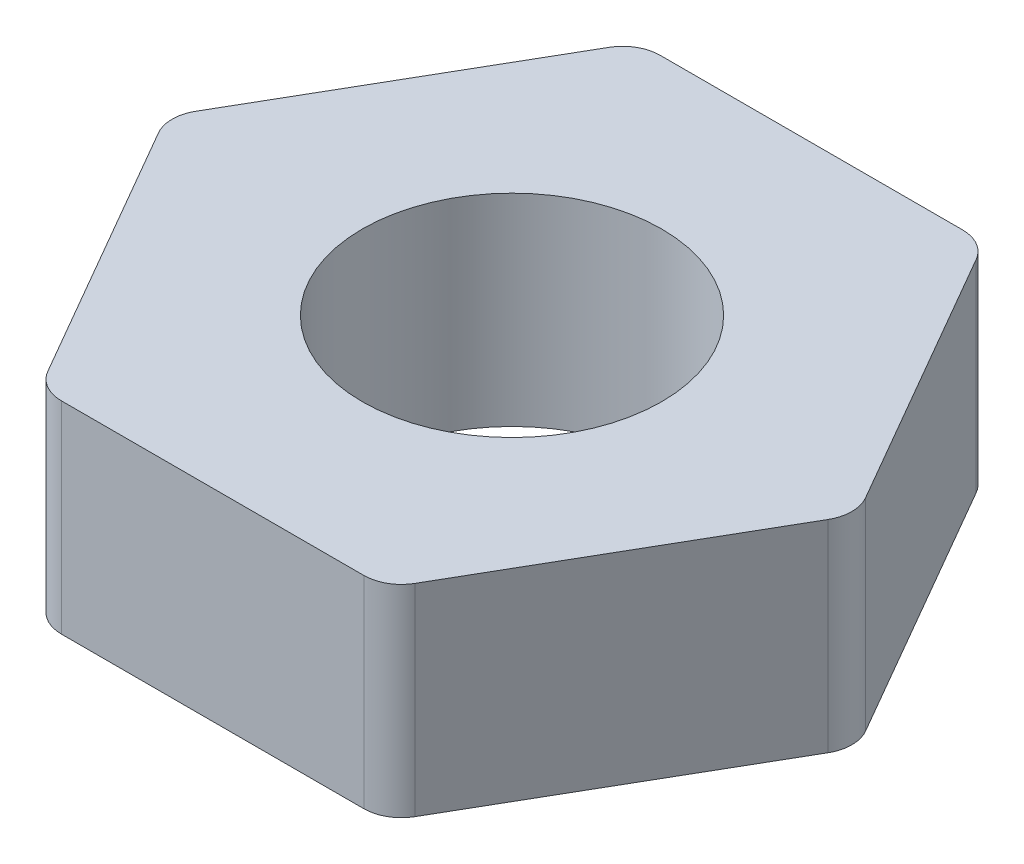
ISO-10303-21;
HEADER;
FILE_DESCRIPTION(('STEP AP214'),'2;1');
FILE_NAME('part.step','',(''),(''),'','','');
FILE_SCHEMA(('AUTOMOTIVE_DESIGN { 1 0 10303 214 1 1 1 1 }'));
ENDSEC;
DATA;
#1=APPLICATION_CONTEXT('core data for automotive mechanical design processes');
#2=APPLICATION_PROTOCOL_DEFINITION('international standard','automotive_design',2000,#1);
#3=PRODUCT_CONTEXT('',#1,'mechanical');
#4=PRODUCT('Part','Part','',(#3));
#5=PRODUCT_RELATED_PRODUCT_CATEGORY('part','',(#4));
#6=PRODUCT_DEFINITION_FORMATION('','',#4);
#7=PRODUCT_DEFINITION_CONTEXT('part definition',#1,'design');
#8=PRODUCT_DEFINITION('design','',#6,#7);
#9=PRODUCT_DEFINITION_SHAPE('','',#8);
#10=(LENGTH_UNIT() NAMED_UNIT(*) SI_UNIT(.MILLI.,.METRE.));
#11=(NAMED_UNIT(*) PLANE_ANGLE_UNIT() SI_UNIT($,.RADIAN.));
#12=(NAMED_UNIT(*) SI_UNIT($,.STERADIAN.) SOLID_ANGLE_UNIT());
#13=UNCERTAINTY_MEASURE_WITH_UNIT(LENGTH_MEASURE(1.E-05),#10,'distance_accuracy_value','');
#14=(GEOMETRIC_REPRESENTATION_CONTEXT(3) GLOBAL_UNCERTAINTY_ASSIGNED_CONTEXT((#13)) GLOBAL_UNIT_ASSIGNED_CONTEXT((#10,
#11,#12)) REPRESENTATION_CONTEXT('',''));
#15=CARTESIAN_POINT('',(0.,0.,0.));
#16=DIRECTION('',(0.,0.,1.));
#17=DIRECTION('',(1.,0.,0.));
#18=AXIS2_PLACEMENT_3D('',#15,#16,#17);
#19=CARTESIAN_POINT('',(0.,2.7,0.));
#20=DIRECTION('',(0.,1.,0.));
#21=DIRECTION('',(0.,0.,1.));
#22=AXIS2_PLACEMENT_3D('',#19,#20,#21);
#23=PLANE('',#22);
#24=DIRECTION('',(-0.5,0.,0.866025403784439));
#25=VECTOR('',#24,1.);
#26=CARTESIAN_POINT('',(-2.30940107675851,2.7,-4.00000000000001));
#27=LINE('',#26,#25);
#28=CARTESIAN_POINT('',(-2.45373864405591,2.7,-3.75000000000001));
#29=VERTEX_POINT('',#28);
#30=CARTESIAN_POINT('',(-4.47446458621961,2.7,-0.249999999999999));
#31=VERTEX_POINT('',#30);
#32=EDGE_CURVE('E220',#29,#31,#27,.T.);
#33=ORIENTED_EDGE('',*,*,#32,.T.);
#34=CARTESIAN_POINT('',(-4.04145188432739,2.7,0.));
#35=DIRECTION('',(0.,1.,0.));
#36=DIRECTION('',(0.,0.,1.));
#37=AXIS2_PLACEMENT_3D('',#34,#35,#36);
#38=CIRCLE('',#37,0.5);
#39=CARTESIAN_POINT('',(-4.47446458621961,2.7,0.25));
#40=VERTEX_POINT('',#39);
#41=EDGE_CURVE('E182',#31,#40,#38,.T.);
#42=ORIENTED_EDGE('',*,*,#41,.T.);
#43=DIRECTION('',(0.5,0.,0.866025403784438));
#44=VECTOR('',#43,1.);
#45=CARTESIAN_POINT('',(-4.61880215351701,2.7,0.));
#46=LINE('',#45,#44);
#47=CARTESIAN_POINT('',(-2.45373864405591,2.7,3.75));
#48=VERTEX_POINT('',#47);
#49=EDGE_CURVE('E144',#40,#48,#46,.T.);
#50=ORIENTED_EDGE('',*,*,#49,.T.);
#51=CARTESIAN_POINT('',(-2.02072594216369,2.7,3.50000000000001));
#52=DIRECTION('',(0.,1.,0.));
#53=DIRECTION('',(0.,0.,1.));
#54=AXIS2_PLACEMENT_3D('',#51,#52,#53);
#55=CIRCLE('',#54,0.5);
#56=CARTESIAN_POINT('',(-2.02072594216369,2.7,4.00000000000001));
#57=VERTEX_POINT('',#56);
#58=EDGE_CURVE('E57',#48,#57,#55,.T.);
#59=ORIENTED_EDGE('',*,*,#58,.T.);
#60=DIRECTION('',(1.,0.,0.));
#61=VECTOR('',#60,1.);
#62=CARTESIAN_POINT('',(-2.30940107675851,2.7,4.00000000000001));
#63=LINE('',#62,#61);
#64=CARTESIAN_POINT('',(2.02072594216369,2.7,4.00000000000001));
#65=VERTEX_POINT('',#64);
#66=EDGE_CURVE('E160',#57,#65,#63,.T.);
#67=ORIENTED_EDGE('',*,*,#66,.T.);
#68=CARTESIAN_POINT('',(2.02072594216369,2.7,3.50000000000001));
#69=DIRECTION('',(0.,1.,0.));
#70=DIRECTION('',(0.,0.,1.));
#71=AXIS2_PLACEMENT_3D('',#68,#69,#70);
#72=CIRCLE('',#71,0.5);
#73=CARTESIAN_POINT('',(2.45373864405591,2.7,3.75));
#74=VERTEX_POINT('',#73);
#75=EDGE_CURVE('E179',#65,#74,#72,.T.);
#76=ORIENTED_EDGE('',*,*,#75,.T.);
#77=DIRECTION('',(0.5,0.,-0.866025403784439));
#78=VECTOR('',#77,1.);
#79=CARTESIAN_POINT('',(2.3094010767585,2.7,4.00000000000001));
#80=LINE('',#79,#78);
#81=CARTESIAN_POINT('',(4.4744645862196,2.7,0.25));
#82=VERTEX_POINT('',#81);
#83=EDGE_CURVE('E154',#74,#82,#80,.T.);
#84=ORIENTED_EDGE('',*,*,#83,.T.);
#85=CARTESIAN_POINT('',(4.04145188432738,2.7,0.));
#86=DIRECTION('',(0.,1.,0.));
#87=DIRECTION('',(0.,0.,1.));
#88=AXIS2_PLACEMENT_3D('',#85,#86,#87);
#89=CIRCLE('',#88,0.5);
#90=CARTESIAN_POINT('',(4.4744645862196,2.7,-0.250000000000001));
#91=VERTEX_POINT('',#90);
#92=EDGE_CURVE('E177',#82,#91,#89,.T.);
#93=ORIENTED_EDGE('',*,*,#92,.T.);
#94=DIRECTION('',(-0.5,0.,-0.866025403784439));
#95=VECTOR('',#94,1.);
#96=CARTESIAN_POINT('',(4.618802153517,2.7,0.));
#97=LINE('',#96,#95);
#98=CARTESIAN_POINT('',(2.45373864405591,2.7,-3.75000000000001));
#99=VERTEX_POINT('',#98);
#100=EDGE_CURVE('E224',#91,#99,#97,.T.);
#101=ORIENTED_EDGE('',*,*,#100,.T.);
#102=CARTESIAN_POINT('',(2.02072594216369,2.7,-3.50000000000001));
#103=DIRECTION('',(0.,1.,0.));
#104=DIRECTION('',(0.,0.,1.));
#105=AXIS2_PLACEMENT_3D('',#102,#103,#104);
#106=CIRCLE('',#105,0.5);
#107=CARTESIAN_POINT('',(2.02072594216369,2.7,-4.00000000000001));
#108=VERTEX_POINT('',#107);
#109=EDGE_CURVE('E173',#99,#108,#106,.T.);
#110=ORIENTED_EDGE('',*,*,#109,.T.);
#111=DIRECTION('',(-1.,0.,0.));
#112=VECTOR('',#111,1.);
#113=CARTESIAN_POINT('',(2.3094010767585,2.7,-4.00000000000001));
#114=LINE('',#113,#112);
#115=CARTESIAN_POINT('',(-2.02072594216369,2.7,-4.00000000000001));
#116=VERTEX_POINT('',#115);
#117=EDGE_CURVE('E206',#108,#116,#114,.T.);
#118=ORIENTED_EDGE('',*,*,#117,.T.);
#119=CARTESIAN_POINT('',(-2.02072594216369,2.7,-3.50000000000001));
#120=DIRECTION('',(0.,1.,0.));
#121=DIRECTION('',(0.,0.,1.));
#122=AXIS2_PLACEMENT_3D('',#119,#120,#121);
#123=CIRCLE('',#122,0.5);
#124=EDGE_CURVE('E175',#116,#29,#123,.T.);
#125=ORIENTED_EDGE('',*,*,#124,.T.);
#126=EDGE_LOOP('',(#33,#42,#50,#59,#67,#76,#84,#93,#101,#110,#118,#125));
#127=FACE_BOUND('',#126,.T.);
#128=CARTESIAN_POINT('',(0.,2.7,0.));
#129=DIRECTION('',(0.,1.,0.));
#130=DIRECTION('',(0.,0.,1.));
#131=AXIS2_PLACEMENT_3D('',#128,#129,#130);
#132=CIRCLE('',#131,2.);
#133=CARTESIAN_POINT('',(0.,2.7,2.));
#134=VERTEX_POINT('',#133);
#135=EDGE_CURVE('E217',#134,#134,#132,.T.);
#136=ORIENTED_EDGE('',*,*,#135,.F.);
#137=EDGE_LOOP('',(#136));
#138=FACE_BOUND('',#137,.T.);
#139=ADVANCED_FACE('F35',(#127,#138),#23,.T.);
#140=CARTESIAN_POINT('',(0.,0.,0.));
#141=DIRECTION('',(0.,1.,0.));
#142=DIRECTION('',(0.,0.,1.));
#143=AXIS2_PLACEMENT_3D('',#140,#141,#142);
#144=PLANE('',#143);
#145=DIRECTION('',(0.5,0.,0.866025403784438));
#146=VECTOR('',#145,1.);
#147=CARTESIAN_POINT('',(-4.61880215351701,0.,0.));
#148=LINE('',#147,#146);
#149=CARTESIAN_POINT('',(-4.47446458621961,0.,0.25));
#150=VERTEX_POINT('',#149);
#151=CARTESIAN_POINT('',(-2.45373864405591,0.,3.75));
#152=VERTEX_POINT('',#151);
#153=EDGE_CURVE('E142',#150,#152,#148,.T.);
#154=ORIENTED_EDGE('',*,*,#153,.F.);
#155=CARTESIAN_POINT('',(-4.04145188432739,0.,0.));
#156=DIRECTION('',(0.,1.,0.));
#157=DIRECTION('',(0.,0.,1.));
#158=AXIS2_PLACEMENT_3D('',#155,#156,#157);
#159=CIRCLE('',#158,0.5);
#160=CARTESIAN_POINT('',(-4.47446458621961,0.,-0.249999999999999));
#161=VERTEX_POINT('',#160);
#162=EDGE_CURVE('E125',#150,#161,#159,.F.);
#163=ORIENTED_EDGE('',*,*,#162,.T.);
#164=DIRECTION('',(-0.5,0.,0.866025403784439));
#165=VECTOR('',#164,1.);
#166=CARTESIAN_POINT('',(-2.30940107675851,0.,-4.00000000000001));
#167=LINE('',#166,#165);
#168=CARTESIAN_POINT('',(-2.45373864405591,0.,-3.75000000000001));
#169=VERTEX_POINT('',#168);
#170=EDGE_CURVE('E152',#169,#161,#167,.T.);
#171=ORIENTED_EDGE('',*,*,#170,.F.);
#172=CARTESIAN_POINT('',(-2.02072594216369,0.,-3.50000000000001));
#173=DIRECTION('',(0.,1.,0.));
#174=DIRECTION('',(0.,0.,1.));
#175=AXIS2_PLACEMENT_3D('',#172,#173,#174);
#176=CIRCLE('',#175,0.5);
#177=CARTESIAN_POINT('',(-2.02072594216369,0.,-4.00000000000001));
#178=VERTEX_POINT('',#177);
#179=EDGE_CURVE('E163',#169,#178,#176,.F.);
#180=ORIENTED_EDGE('',*,*,#179,.T.);
#181=DIRECTION('',(-1.,0.,0.));
#182=VECTOR('',#181,1.);
#183=CARTESIAN_POINT('',(2.3094010767585,0.,-4.00000000000001));
#184=LINE('',#183,#182);
#185=CARTESIAN_POINT('',(2.02072594216369,0.,-4.00000000000001));
#186=VERTEX_POINT('',#185);
#187=EDGE_CURVE('E156',#186,#178,#184,.T.);
#188=ORIENTED_EDGE('',*,*,#187,.F.);
#189=CARTESIAN_POINT('',(2.02072594216369,0.,-3.50000000000001));
#190=DIRECTION('',(0.,1.,0.));
#191=DIRECTION('',(0.,0.,1.));
#192=AXIS2_PLACEMENT_3D('',#189,#190,#191);
#193=CIRCLE('',#192,0.5);
#194=CARTESIAN_POINT('',(2.45373864405591,0.,-3.75000000000001));
#195=VERTEX_POINT('',#194);
#196=EDGE_CURVE('E145',#186,#195,#193,.F.);
#197=ORIENTED_EDGE('',*,*,#196,.T.);
#198=DIRECTION('',(-0.5,0.,-0.866025403784439));
#199=VECTOR('',#198,1.);
#200=CARTESIAN_POINT('',(4.618802153517,0.,0.));
#201=LINE('',#200,#199);
#202=CARTESIAN_POINT('',(4.4744645862196,0.,-0.250000000000001));
#203=VERTEX_POINT('',#202);
#204=EDGE_CURVE('E211',#203,#195,#201,.T.);
#205=ORIENTED_EDGE('',*,*,#204,.F.);
#206=CARTESIAN_POINT('',(4.04145188432738,0.,0.));
#207=DIRECTION('',(0.,1.,0.));
#208=DIRECTION('',(0.,0.,1.));
#209=AXIS2_PLACEMENT_3D('',#206,#207,#208);
#210=CIRCLE('',#209,0.5);
#211=CARTESIAN_POINT('',(4.4744645862196,0.,0.25));
#212=VERTEX_POINT('',#211);
#213=EDGE_CURVE('E165',#203,#212,#210,.F.);
#214=ORIENTED_EDGE('',*,*,#213,.T.);
#215=DIRECTION('',(0.5,0.,-0.866025403784439));
#216=VECTOR('',#215,1.);
#217=CARTESIAN_POINT('',(2.3094010767585,0.,4.00000000000001));
#218=LINE('',#217,#216);
#219=CARTESIAN_POINT('',(2.45373864405591,0.,3.75));
#220=VERTEX_POINT('',#219);
#221=EDGE_CURVE('E212',#220,#212,#218,.T.);
#222=ORIENTED_EDGE('',*,*,#221,.F.);
#223=CARTESIAN_POINT('',(2.02072594216369,0.,3.50000000000001));
#224=DIRECTION('',(0.,1.,0.));
#225=DIRECTION('',(0.,0.,1.));
#226=AXIS2_PLACEMENT_3D('',#223,#224,#225);
#227=CIRCLE('',#226,0.5);
#228=CARTESIAN_POINT('',(2.02072594216369,0.,4.00000000000001));
#229=VERTEX_POINT('',#228);
#230=EDGE_CURVE('E167',#220,#229,#227,.F.);
#231=ORIENTED_EDGE('',*,*,#230,.T.);
#232=DIRECTION('',(1.,0.,0.));
#233=VECTOR('',#232,1.);
#234=CARTESIAN_POINT('',(-2.30940107675851,0.,4.00000000000001));
#235=LINE('',#234,#233);
#236=CARTESIAN_POINT('',(-2.02072594216369,0.,4.00000000000001));
#237=VERTEX_POINT('',#236);
#238=EDGE_CURVE('E151',#237,#229,#235,.T.);
#239=ORIENTED_EDGE('',*,*,#238,.F.);
#240=CARTESIAN_POINT('',(-2.02072594216369,0.,3.50000000000001));
#241=DIRECTION('',(0.,1.,0.));
#242=DIRECTION('',(0.,0.,1.));
#243=AXIS2_PLACEMENT_3D('',#240,#241,#242);
#244=CIRCLE('',#243,0.5);
#245=EDGE_CURVE('E136',#237,#152,#244,.F.);
#246=ORIENTED_EDGE('',*,*,#245,.T.);
#247=EDGE_LOOP('',(#154,#163,#171,#180,#188,#197,#205,#214,#222,#231,#239,#246));
#248=FACE_BOUND('',#247,.T.);
#249=CARTESIAN_POINT('',(0.,0.,0.));
#250=DIRECTION('',(0.,1.,0.));
#251=DIRECTION('',(0.,0.,1.));
#252=AXIS2_PLACEMENT_3D('',#249,#250,#251);
#253=CIRCLE('',#252,2.);
#254=CARTESIAN_POINT('',(0.,0.,2.));
#255=VERTEX_POINT('',#254);
#256=EDGE_CURVE('E229',#255,#255,#253,.T.);
#257=ORIENTED_EDGE('',*,*,#256,.T.);
#258=EDGE_LOOP('',(#257));
#259=FACE_BOUND('',#258,.T.);
#260=ADVANCED_FACE('F148',(#248,#259),#144,.F.);
#261=CARTESIAN_POINT('',(2.3094010767585,2.7,4.00000000000001));
#262=DIRECTION('',(-0.866025403784439,0.,-0.5));
#263=DIRECTION('',(-0.5,0.,0.866025403784439));
#264=AXIS2_PLACEMENT_3D('',#261,#262,#263);
#265=PLANE('',#264);
#266=ORIENTED_EDGE('',*,*,#83,.F.);
#267=DIRECTION('',(0.,-1.,0.));
#268=VECTOR('',#267,1.);
#269=CARTESIAN_POINT('',(2.45373864405591,2.7,3.75));
#270=LINE('',#269,#268);
#271=EDGE_CURVE('E190',#74,#220,#270,.T.);
#272=ORIENTED_EDGE('',*,*,#271,.T.);
#273=ORIENTED_EDGE('',*,*,#221,.T.);
#274=DIRECTION('',(0.,-1.,0.));
#275=VECTOR('',#274,1.);
#276=CARTESIAN_POINT('',(4.4744645862196,2.7,0.249999999999999));
#277=LINE('',#276,#275);
#278=EDGE_CURVE('E188',#212,#82,#277,.F.);
#279=ORIENTED_EDGE('',*,*,#278,.T.);
#280=EDGE_LOOP('',(#266,#272,#273,#279));
#281=FACE_BOUND('',#280,.T.);
#282=ADVANCED_FACE('F243',(#281),#265,.F.);
#283=CARTESIAN_POINT('',(4.618802153517,2.7,0.));
#284=DIRECTION('',(-0.866025403784439,0.,0.5));
#285=DIRECTION('',(0.5,0.,0.866025403784439));
#286=AXIS2_PLACEMENT_3D('',#283,#284,#285);
#287=PLANE('',#286);
#288=ORIENTED_EDGE('',*,*,#100,.F.);
#289=DIRECTION('',(0.,-1.,0.));
#290=VECTOR('',#289,1.);
#291=CARTESIAN_POINT('',(4.4744645862196,2.7,-0.250000000000001));
#292=LINE('',#291,#290);
#293=EDGE_CURVE('E195',#91,#203,#292,.T.);
#294=ORIENTED_EDGE('',*,*,#293,.T.);
#295=ORIENTED_EDGE('',*,*,#204,.T.);
#296=DIRECTION('',(0.,-1.,0.));
#297=VECTOR('',#296,1.);
#298=CARTESIAN_POINT('',(2.45373864405591,2.7,-3.75000000000001));
#299=LINE('',#298,#297);
#300=EDGE_CURVE('E193',#195,#99,#299,.F.);
#301=ORIENTED_EDGE('',*,*,#300,.T.);
#302=EDGE_LOOP('',(#288,#294,#295,#301));
#303=FACE_BOUND('',#302,.T.);
#304=ADVANCED_FACE('F258',(#303),#287,.F.);
#305=CARTESIAN_POINT('',(2.3094010767585,2.7,-4.00000000000001));
#306=DIRECTION('',(0.,0.,1.));
#307=DIRECTION('',(1.,0.,0.));
#308=AXIS2_PLACEMENT_3D('',#305,#306,#307);
#309=PLANE('',#308);
#310=ORIENTED_EDGE('',*,*,#187,.T.);
#311=DIRECTION('',(0.,-1.,0.));
#312=VECTOR('',#311,1.);
#313=CARTESIAN_POINT('',(-2.02072594216369,2.7,-4.00000000000001));
#314=LINE('',#313,#312);
#315=EDGE_CURVE('E11',#178,#116,#314,.F.);
#316=ORIENTED_EDGE('',*,*,#315,.T.);
#317=ORIENTED_EDGE('',*,*,#117,.F.);
#318=DIRECTION('',(0.,-1.,0.));
#319=VECTOR('',#318,1.);
#320=CARTESIAN_POINT('',(2.02072594216369,2.7,-4.00000000000001));
#321=LINE('',#320,#319);
#322=EDGE_CURVE('E43',#108,#186,#321,.T.);
#323=ORIENTED_EDGE('',*,*,#322,.T.);
#324=EDGE_LOOP('',(#310,#316,#317,#323));
#325=FACE_BOUND('',#324,.T.);
#326=ADVANCED_FACE('F203',(#325),#309,.F.);
#327=CARTESIAN_POINT('',(-2.30940107675851,2.7,-4.00000000000001));
#328=DIRECTION('',(0.866025403784439,0.,0.5));
#329=DIRECTION('',(0.5,0.,-0.866025403784439));
#330=AXIS2_PLACEMENT_3D('',#327,#328,#329);
#331=PLANE('',#330);
#332=ORIENTED_EDGE('',*,*,#170,.T.);
#333=DIRECTION('',(0.,-1.,0.));
#334=VECTOR('',#333,1.);
#335=CARTESIAN_POINT('',(-4.47446458621961,2.7,-0.249999999999999));
#336=LINE('',#335,#334);
#337=EDGE_CURVE('E130',#161,#31,#336,.F.);
#338=ORIENTED_EDGE('',*,*,#337,.T.);
#339=ORIENTED_EDGE('',*,*,#32,.F.);
#340=DIRECTION('',(0.,-1.,0.));
#341=VECTOR('',#340,1.);
#342=CARTESIAN_POINT('',(-2.45373864405591,2.7,-3.75000000000001));
#343=LINE('',#342,#341);
#344=EDGE_CURVE('E135',#29,#169,#343,.T.);
#345=ORIENTED_EDGE('',*,*,#344,.T.);
#346=EDGE_LOOP('',(#332,#338,#339,#345));
#347=FACE_BOUND('',#346,.T.);
#348=ADVANCED_FACE('F252',(#347),#331,.F.);
#349=CARTESIAN_POINT('',(-4.61880215351701,2.7,0.));
#350=DIRECTION('',(0.866025403784439,0.,-0.5));
#351=DIRECTION('',(-0.5,0.,-0.866025403784438));
#352=AXIS2_PLACEMENT_3D('',#349,#350,#351);
#353=PLANE('',#352);
#354=ORIENTED_EDGE('',*,*,#49,.F.);
#355=DIRECTION('',(0.,-1.,0.));
#356=VECTOR('',#355,1.);
#357=CARTESIAN_POINT('',(-4.47446458621961,2.7,0.25));
#358=LINE('',#357,#356);
#359=EDGE_CURVE('E129',#40,#150,#358,.T.);
#360=ORIENTED_EDGE('',*,*,#359,.T.);
#361=ORIENTED_EDGE('',*,*,#153,.T.);
#362=DIRECTION('',(0.,-1.,0.));
#363=VECTOR('',#362,1.);
#364=CARTESIAN_POINT('',(-2.45373864405591,2.7,3.75000000000001));
#365=LINE('',#364,#363);
#366=EDGE_CURVE('E146',#152,#48,#365,.F.);
#367=ORIENTED_EDGE('',*,*,#366,.T.);
#368=EDGE_LOOP('',(#354,#360,#361,#367));
#369=FACE_BOUND('',#368,.T.);
#370=ADVANCED_FACE('F141',(#369),#353,.F.);
#371=CARTESIAN_POINT('',(-2.30940107675851,2.7,4.00000000000001));
#372=DIRECTION('',(0.,0.,-1.));
#373=DIRECTION('',(-1.,0.,0.));
#374=AXIS2_PLACEMENT_3D('',#371,#372,#373);
#375=PLANE('',#374);
#376=ORIENTED_EDGE('',*,*,#66,.F.);
#377=DIRECTION('',(0.,-1.,0.));
#378=VECTOR('',#377,1.);
#379=CARTESIAN_POINT('',(-2.02072594216369,2.7,4.00000000000001));
#380=LINE('',#379,#378);
#381=EDGE_CURVE('E185',#57,#237,#380,.T.);
#382=ORIENTED_EDGE('',*,*,#381,.T.);
#383=ORIENTED_EDGE('',*,*,#238,.T.);
#384=DIRECTION('',(0.,-1.,0.));
#385=VECTOR('',#384,1.);
#386=CARTESIAN_POINT('',(2.02072594216369,2.7,4.00000000000001));
#387=LINE('',#386,#385);
#388=EDGE_CURVE('E50',#229,#65,#387,.F.);
#389=ORIENTED_EDGE('',*,*,#388,.T.);
#390=EDGE_LOOP('',(#376,#382,#383,#389));
#391=FACE_BOUND('',#390,.T.);
#392=ADVANCED_FACE('F247',(#391),#375,.F.);
#393=CARTESIAN_POINT('',(0.,2.7,0.));
#394=DIRECTION('',(0.,-1.,0.));
#395=DIRECTION('',(0.,0.,-1.));
#396=AXIS2_PLACEMENT_3D('',#393,#394,#395);
#397=CYLINDRICAL_SURFACE('',#396,2.);
#398=ORIENTED_EDGE('',*,*,#135,.T.);
#399=EDGE_LOOP('',(#398));
#400=FACE_BOUND('',#399,.T.);
#401=ORIENTED_EDGE('',*,*,#256,.F.);
#402=EDGE_LOOP('',(#401));
#403=FACE_BOUND('',#402,.T.);
#404=ADVANCED_FACE('F235',(#400,#403),#397,.F.);
#405=CARTESIAN_POINT('',(-4.04145188432739,2.7,0.));
#406=DIRECTION('',(0.,-1.,0.));
#407=DIRECTION('',(0.,0.,-1.));
#408=AXIS2_PLACEMENT_3D('',#405,#406,#407);
#409=CYLINDRICAL_SURFACE('',#408,0.5);
#410=ORIENTED_EDGE('',*,*,#41,.F.);
#411=ORIENTED_EDGE('',*,*,#337,.F.);
#412=ORIENTED_EDGE('',*,*,#162,.F.);
#413=ORIENTED_EDGE('',*,*,#359,.F.);
#414=EDGE_LOOP('',(#410,#411,#412,#413));
#415=FACE_BOUND('',#414,.T.);
#416=ADVANCED_FACE('F128',(#415),#409,.T.);
#417=CARTESIAN_POINT('',(-2.02072594216369,2.7,3.50000000000001));
#418=DIRECTION('',(0.,-1.,0.));
#419=DIRECTION('',(0.,0.,-1.));
#420=AXIS2_PLACEMENT_3D('',#417,#418,#419);
#421=CYLINDRICAL_SURFACE('',#420,0.5);
#422=ORIENTED_EDGE('',*,*,#58,.F.);
#423=ORIENTED_EDGE('',*,*,#366,.F.);
#424=ORIENTED_EDGE('',*,*,#245,.F.);
#425=ORIENTED_EDGE('',*,*,#381,.F.);
#426=EDGE_LOOP('',(#422,#423,#424,#425));
#427=FACE_BOUND('',#426,.T.);
#428=ADVANCED_FACE('F267',(#427),#421,.T.);
#429=CARTESIAN_POINT('',(2.02072594216369,2.7,3.50000000000001));
#430=DIRECTION('',(0.,-1.,0.));
#431=DIRECTION('',(0.,0.,-1.));
#432=AXIS2_PLACEMENT_3D('',#429,#430,#431);
#433=CYLINDRICAL_SURFACE('',#432,0.5);
#434=ORIENTED_EDGE('',*,*,#75,.F.);
#435=ORIENTED_EDGE('',*,*,#388,.F.);
#436=ORIENTED_EDGE('',*,*,#230,.F.);
#437=ORIENTED_EDGE('',*,*,#271,.F.);
#438=EDGE_LOOP('',(#434,#435,#436,#437));
#439=FACE_BOUND('',#438,.T.);
#440=ADVANCED_FACE('F270',(#439),#433,.T.);
#441=CARTESIAN_POINT('',(4.04145188432738,2.7,0.));
#442=DIRECTION('',(0.,-1.,0.));
#443=DIRECTION('',(0.,0.,-1.));
#444=AXIS2_PLACEMENT_3D('',#441,#442,#443);
#445=CYLINDRICAL_SURFACE('',#444,0.5);
#446=ORIENTED_EDGE('',*,*,#92,.F.);
#447=ORIENTED_EDGE('',*,*,#278,.F.);
#448=ORIENTED_EDGE('',*,*,#213,.F.);
#449=ORIENTED_EDGE('',*,*,#293,.F.);
#450=EDGE_LOOP('',(#446,#447,#448,#449));
#451=FACE_BOUND('',#450,.T.);
#452=ADVANCED_FACE('F274',(#451),#445,.T.);
#453=CARTESIAN_POINT('',(-2.02072594216369,2.7,-3.50000000000001));
#454=DIRECTION('',(0.,-1.,0.));
#455=DIRECTION('',(0.,0.,-1.));
#456=AXIS2_PLACEMENT_3D('',#453,#454,#455);
#457=CYLINDRICAL_SURFACE('',#456,0.5);
#458=ORIENTED_EDGE('',*,*,#124,.F.);
#459=ORIENTED_EDGE('',*,*,#315,.F.);
#460=ORIENTED_EDGE('',*,*,#179,.F.);
#461=ORIENTED_EDGE('',*,*,#344,.F.);
#462=EDGE_LOOP('',(#458,#459,#460,#461));
#463=FACE_BOUND('',#462,.T.);
#464=ADVANCED_FACE('F277',(#463),#457,.T.);
#465=CARTESIAN_POINT('',(2.02072594216369,2.7,-3.50000000000001));
#466=DIRECTION('',(0.,-1.,0.));
#467=DIRECTION('',(0.,0.,-1.));
#468=AXIS2_PLACEMENT_3D('',#465,#466,#467);
#469=CYLINDRICAL_SURFACE('',#468,0.5);
#470=ORIENTED_EDGE('',*,*,#109,.F.);
#471=ORIENTED_EDGE('',*,*,#300,.F.);
#472=ORIENTED_EDGE('',*,*,#196,.F.);
#473=ORIENTED_EDGE('',*,*,#322,.F.);
#474=EDGE_LOOP('',(#470,#471,#472,#473));
#475=FACE_BOUND('',#474,.T.);
#476=ADVANCED_FACE('F37',(#475),#469,.T.);
#477=CLOSED_SHELL('',(#139,#260,#282,#304,#326,#348,#370,#392,#404,#416,#428,#440,#452,#464,#476));
#478=MANIFOLD_SOLID_BREP('B2',#477);
#479=ADVANCED_BREP_SHAPE_REPRESENTATION('',(#18,#478),#14);
#480=SHAPE_DEFINITION_REPRESENTATION(#9,#479);
ENDSEC;
END-ISO-10303-21;
